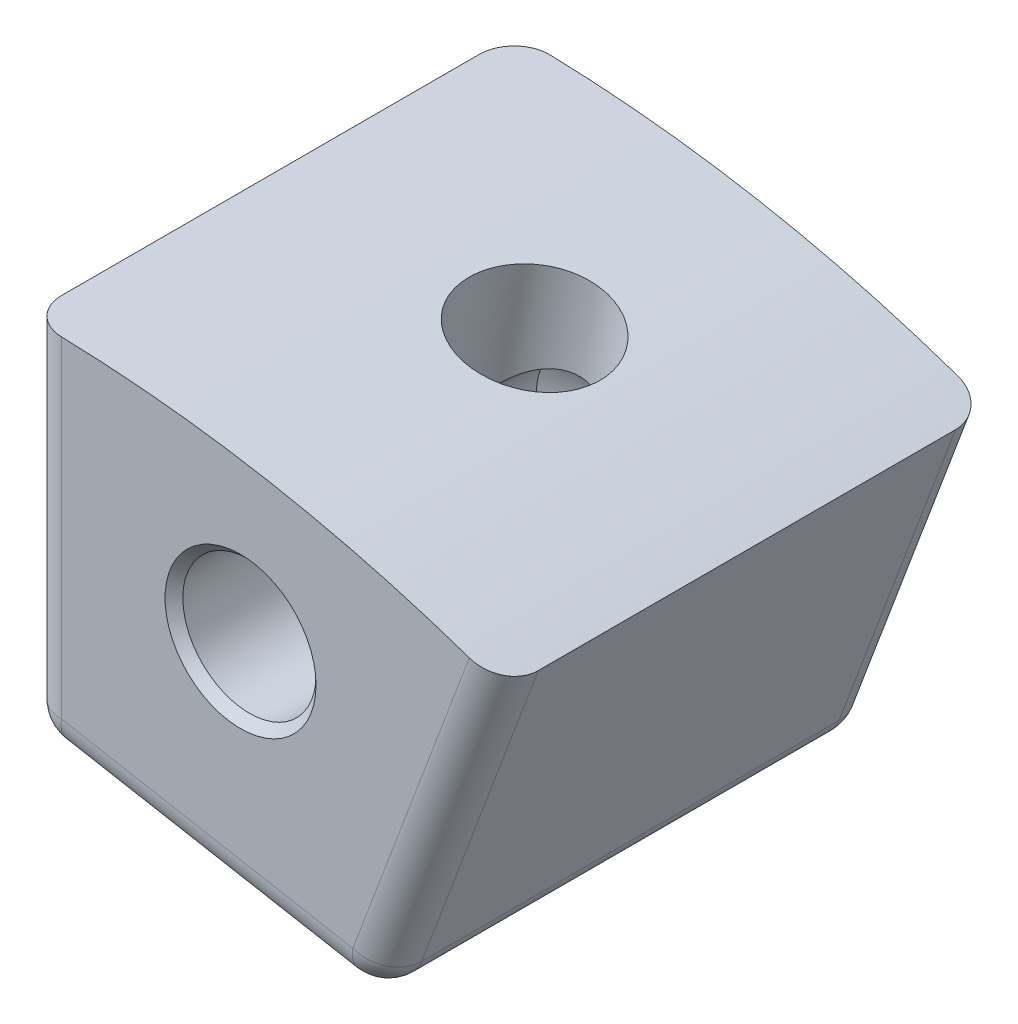
ISO-10303-21;
HEADER;
FILE_DESCRIPTION(('STEP AP214'),'2;1');
FILE_NAME('part.step','',(''),(''),'','','');
FILE_SCHEMA(('AUTOMOTIVE_DESIGN { 1 0 10303 214 1 1 1 1 }'));
ENDSEC;
DATA;
#1=APPLICATION_CONTEXT('core data for automotive mechanical design processes');
#2=APPLICATION_PROTOCOL_DEFINITION('international standard','automotive_design',2000,#1);
#3=PRODUCT_CONTEXT('',#1,'mechanical');
#4=PRODUCT('Part','Part','',(#3));
#5=PRODUCT_RELATED_PRODUCT_CATEGORY('part','',(#4));
#6=PRODUCT_DEFINITION_FORMATION('','',#4);
#7=PRODUCT_DEFINITION_CONTEXT('part definition',#1,'design');
#8=PRODUCT_DEFINITION('design','',#6,#7);
#9=PRODUCT_DEFINITION_SHAPE('','',#8);
#10=(LENGTH_UNIT() NAMED_UNIT(*) SI_UNIT(.MILLI.,.METRE.));
#11=(NAMED_UNIT(*) PLANE_ANGLE_UNIT() SI_UNIT($,.RADIAN.));
#12=(NAMED_UNIT(*) SI_UNIT($,.STERADIAN.) SOLID_ANGLE_UNIT());
#13=UNCERTAINTY_MEASURE_WITH_UNIT(LENGTH_MEASURE(1.E-05),#10,'distance_accuracy_value','');
#14=(GEOMETRIC_REPRESENTATION_CONTEXT(3) GLOBAL_UNCERTAINTY_ASSIGNED_CONTEXT((#13)) GLOBAL_UNIT_ASSIGNED_CONTEXT((#10,
#11,#12)) REPRESENTATION_CONTEXT('',''));
#15=CARTESIAN_POINT('',(0.,0.,0.));
#16=DIRECTION('',(0.,0.,1.));
#17=DIRECTION('',(1.,0.,0.));
#18=AXIS2_PLACEMENT_3D('',#15,#16,#17);
#19=CARTESIAN_POINT('',(0.,0.,34.925));
#20=DIRECTION('',(0.936047275217543,-0.351874265267883,0.));
#21=DIRECTION('',(0.351874265267883,0.936047275217543,0.));
#22=AXIS2_PLACEMENT_3D('',#19,#20,#21);
#23=PLANE('',#22);
#24=DIRECTION('',(0.,0.,-1.));
#25=VECTOR('',#24,1.);
#26=CARTESIAN_POINT('',(25.7365632458568,68.4637732214032,0.));
#27=LINE('',#26,#25);
#28=CARTESIAN_POINT('',(25.7365632458568,68.4637732214032,32.385));
#29=VERTEX_POINT('',#28);
#30=CARTESIAN_POINT('',(25.7365632458568,68.4637732214032,2.54));
#31=VERTEX_POINT('',#30);
#32=EDGE_CURVE('E264',#29,#31,#27,.T.);
#33=ORIENTED_EDGE('',*,*,#32,.T.);
#34=DIRECTION('',(-0.351874265267883,-0.936047275217543,0.));
#35=VECTOR('',#34,1.);
#36=CARTESIAN_POINT('',(34.0746241628786,90.6444780138789,2.54));
#37=LINE('',#36,#35);
#38=CARTESIAN_POINT('',(34.0746241628786,90.6444780138788,2.54));
#39=VERTEX_POINT('',#38);
#40=EDGE_CURVE('E11',#31,#39,#37,.F.);
#41=ORIENTED_EDGE('',*,*,#40,.T.);
#42=DIRECTION('',(0.,0.,-1.));
#43=VECTOR('',#42,1.);
#44=CARTESIAN_POINT('',(34.0746241628786,90.6444780138788,34.925));
#45=LINE('',#44,#43);
#46=CARTESIAN_POINT('',(34.0746241628786,90.6444780138788,32.385));
#47=VERTEX_POINT('',#46);
#48=EDGE_CURVE('E360',#47,#39,#45,.T.);
#49=ORIENTED_EDGE('',*,*,#48,.F.);
#50=DIRECTION('',(-0.351874265267883,-0.936047275217543,0.));
#51=VECTOR('',#50,1.);
#52=CARTESIAN_POINT('',(0.,0.,32.385));
#53=LINE('',#52,#51);
#54=EDGE_CURVE('E269',#47,#29,#53,.T.);
#55=ORIENTED_EDGE('',*,*,#54,.T.);
#56=EDGE_LOOP('',(#33,#41,#49,#55));
#57=FACE_BOUND('',#56,.T.);
#58=ADVANCED_FACE('F45',(#57),#23,.T.);
#59=CARTESIAN_POINT('',(0.,0.,34.925));
#60=DIRECTION('',(0.,0.,-1.));
#61=DIRECTION('',(-1.,0.,0.));
#62=AXIS2_PLACEMENT_3D('',#59,#60,#61);
#63=CYLINDRICAL_SURFACE('',#62,96.8375);
#64=CARTESIAN_POINT('',(12.6097274840979,96.0130000522158,15.875));
#65=CARTESIAN_POINT('',(12.6097264337709,96.0130000982698,16.0087169795758));
#66=CARTESIAN_POINT('',(12.6153202061026,96.0122660124806,16.1424171714099));
#67=CARTESIAN_POINT('',(12.6376545638643,96.009328841513,16.4089106540673));
#68=CARTESIAN_POINT('',(12.6543980193311,96.0071253781022,16.5417037024894));
#69=CARTESIAN_POINT('',(12.6989322266272,96.0012449371573,16.8055075697956));
#70=CARTESIAN_POINT('',(12.7267325686475,95.9975666804386,16.9365167391425));
#71=CARTESIAN_POINT('',(12.7931879767186,95.9887330400355,17.1957533270281));
#72=CARTESIAN_POINT('',(12.8318470106102,95.9835771163873,17.3239797102322));
#73=CARTESIAN_POINT('',(12.9196933840178,95.9717921555051,17.5765773818267));
#74=CARTESIAN_POINT('',(12.968871457817,95.9651644145293,17.7009519534236));
#75=CARTESIAN_POINT('',(13.0774367221704,95.950430197253,17.9451268057173));
#76=CARTESIAN_POINT('',(13.1368276704419,95.9423231766003,18.0649253828274));
#77=CARTESIAN_POINT('',(13.2653341298993,95.9246397880624,18.2989792318412));
#78=CARTESIAN_POINT('',(13.3344437210756,95.9150643143509,18.4132378218113));
#79=CARTESIAN_POINT('',(13.4819401690518,95.8944432186642,18.6355221768293));
#80=CARTESIAN_POINT('',(13.5603304435378,95.8833970549078,18.7435456238156));
#81=CARTESIAN_POINT('',(13.7258406224072,95.8598440086538,18.9526009278252));
#82=CARTESIAN_POINT('',(13.812964802504,95.8473364102048,19.053629319075));
#83=CARTESIAN_POINT('',(13.9953141341957,95.820880171416,19.247956450197));
#84=CARTESIAN_POINT('',(14.0905422659883,95.8069310005355,19.3412523213506));
#85=CARTESIAN_POINT('',(14.2883515720941,95.7776299891186,19.519381867384));
#86=CARTESIAN_POINT('',(14.3909303239229,95.7622786102426,19.604218308327));
#87=CARTESIAN_POINT('',(14.6027684994685,95.7302044107346,19.7648916592407));
#88=CARTESIAN_POINT('',(14.7120303754421,95.7134810859134,19.8407252353842));
#89=CARTESIAN_POINT('',(14.9364286075251,95.6787196562656,19.9828260075398));
#90=CARTESIAN_POINT('',(15.0515656746484,95.6606813921917,20.049092041957));
#91=CARTESIAN_POINT('',(15.2869143894984,95.6233541476357,20.1715973069212));
#92=CARTESIAN_POINT('',(15.4071278964905,95.6040647074945,20.2278328236631));
#93=CARTESIAN_POINT('',(15.6516920287323,95.5643305096099,20.3298264780207));
#94=CARTESIAN_POINT('',(15.7760410841597,95.5438861882376,20.375588540443));
#95=CARTESIAN_POINT('',(16.0280267055225,95.5019378882693,20.4563486284289));
#96=CARTESIAN_POINT('',(16.1556644670684,95.4804335216231,20.4913426776877));
#97=CARTESIAN_POINT('',(16.5418428009408,95.41455136751,20.5796640877488));
#98=CARTESIAN_POINT('',(16.8041170662697,95.3687286668414,20.6165256069463));
#99=CARTESIAN_POINT('',(17.330499936498,95.2744814065114,20.6450106597346));
#100=CARTESIAN_POINT('',(17.594608527308,95.2260568668155,20.6366345404133));
#101=CARTESIAN_POINT('',(18.1171033792273,95.1280322876324,20.5749705272961));
#102=CARTESIAN_POINT('',(18.37549439202,95.0784333010608,20.5217214840228));
#103=CARTESIAN_POINT('',(18.8794556537255,94.979648142739,20.3718677359072));
#104=CARTESIAN_POINT('',(19.1250258501679,94.9304619726789,20.2752628536431));
#105=CARTESIAN_POINT('',(19.5965771941678,94.8342425504268,20.0413995529447));
#106=CARTESIAN_POINT('',(19.8225497520565,94.7872102464968,19.9041234235045));
#107=CARTESIAN_POINT('',(20.2484835638455,94.697137165189,19.5928262142636));
#108=CARTESIAN_POINT('',(20.4484446403499,94.6540964150339,19.4188048838851));
#109=CARTESIAN_POINT('',(20.8170010031004,94.573725590792,19.0387376954902));
#110=CARTESIAN_POINT('',(20.9855628521417,94.5364016119563,18.8326581220657));
#111=CARTESIAN_POINT('',(21.2863785712438,94.4691236865632,18.3944426757807));
#112=CARTESIAN_POINT('',(21.4186324318896,94.4391697419168,18.1623067961634));
#113=CARTESIAN_POINT('',(21.6431630204133,94.3879665426444,17.6785478006151));
#114=CARTESIAN_POINT('',(21.7354385074731,94.3667175581974,17.4269240801211));
#115=CARTESIAN_POINT('',(21.8774374576774,94.3338989621334,16.9113413049208));
#116=CARTESIAN_POINT('',(21.9271612304554,94.3223292800838,16.6473823399885));
#117=CARTESIAN_POINT('',(21.9826419968879,94.3094146165876,16.1149179617259));
#118=CARTESIAN_POINT('',(21.988444989211,94.3080589379209,15.8464176002016));
#119=CARTESIAN_POINT('',(21.9560439615805,94.3156074350139,15.31223194224));
#120=CARTESIAN_POINT('',(21.9178400823427,94.324511577967,15.046546636804));
#121=CARTESIAN_POINT('',(21.7985188241056,94.3521578568163,14.5256653756822));
#122=CARTESIAN_POINT('',(21.7174225038293,94.3708951649294,14.2704643387821));
#123=CARTESIAN_POINT('',(21.5145803501038,94.417344813966,13.7776393414879));
#124=CARTESIAN_POINT('',(21.3928342891723,94.4450572051156,13.5400154794675));
#125=CARTESIAN_POINT('',(21.1119478327881,94.5082415796613,13.0888730482716));
#126=CARTESIAN_POINT('',(20.9527763988756,94.5437200020636,12.8753747062041));
#127=CARTESIAN_POINT('',(20.6015044553432,94.6208838955605,12.4787473031764));
#128=CARTESIAN_POINT('',(20.4094037416475,94.6625694051227,12.2956184304418));
#129=CARTESIAN_POINT('',(19.9974312173249,94.7504536780258,11.9647694848802));
#130=CARTESIAN_POINT('',(19.7775357586899,94.7966562768718,11.8170798779212));
#131=CARTESIAN_POINT('',(19.3162281633352,94.8917283106778,11.5615115245329));
#132=CARTESIAN_POINT('',(19.0748161179919,94.940597734312,11.4536326090464));
#133=CARTESIAN_POINT('',(18.5774141882452,95.0391779734488,11.2807958990739));
#134=CARTESIAN_POINT('',(18.3214309846347,95.0888883961268,11.2158186038951));
#135=CARTESIAN_POINT('',(17.8018322180675,95.1875302179342,11.1305855385252));
#136=CARTESIAN_POINT('',(17.5382166963313,95.2364616212687,11.110329526849));
#137=CARTESIAN_POINT('',(17.1431928633069,95.3080817073671,11.1138661018212));
#138=CARTESIAN_POINT('',(17.0115836453829,95.3316591036374,11.1206986062151));
#139=CARTESIAN_POINT('',(16.7493148315705,95.3780872625981,11.1455846488024));
#140=CARTESIAN_POINT('',(16.6186549027394,95.4009382905822,11.1636340395493));
#141=CARTESIAN_POINT('',(16.3591649466284,95.4457777487616,11.2108384852169));
#142=CARTESIAN_POINT('',(16.2303356146225,95.4677658565198,11.2399976486231));
#143=CARTESIAN_POINT('',(15.9755119252488,95.5107381936583,11.3091974096719));
#144=CARTESIAN_POINT('',(15.849516541711,95.5317227896129,11.3492339976218));
#145=CARTESIAN_POINT('',(15.6011692676313,95.5725942394032,11.4399252922864));
#146=CARTESIAN_POINT('',(15.4788187617995,95.5924806784316,11.490583977098));
#147=CARTESIAN_POINT('',(15.2387304604636,95.6310476719757,11.6021285297912));
#148=CARTESIAN_POINT('',(15.120990984016,95.6497286675731,11.6630106271292));
#149=CARTESIAN_POINT('',(14.890882207102,95.6858223745719,11.7946044018872));
#150=CARTESIAN_POINT('',(14.7785147239272,95.7032346578101,11.8653193744906));
#151=CARTESIAN_POINT('',(14.5600389973123,95.7367164771253,12.0160334434758));
#152=CARTESIAN_POINT('',(14.4539284685908,95.7527865043505,12.0960291181095));
#153=CARTESIAN_POINT('',(14.2485486659541,95.7835636523922,12.264870073404));
#154=CARTESIAN_POINT('',(14.1492885831118,95.7982689509614,12.353726866717));
#155=CARTESIAN_POINT('',(13.9585145271971,95.8262519990268,12.5395372591897));
#156=CARTESIAN_POINT('',(13.8669977171235,95.8395302718465,12.6364878668244));
#157=CARTESIAN_POINT('',(13.6922765154636,95.8646481614532,12.8378895237048));
#158=CARTESIAN_POINT('',(13.6090772742859,95.8764868878128,12.942345152257));
#159=CARTESIAN_POINT('',(13.4516876159981,95.8986956269046,13.1579233781543));
#160=CARTESIAN_POINT('',(13.3774938880412,95.9090661796406,13.2690435027334));
#161=CARTESIAN_POINT('',(13.2385271082338,95.9283468850192,13.4973484070362));
#162=CARTESIAN_POINT('',(13.1737665650152,95.9372551005179,13.6145409649143));
#163=CARTESIAN_POINT('',(13.0542775868105,95.9535871118471,13.8539781593823));
#164=CARTESIAN_POINT('',(12.999545488779,95.9610114497771,13.976220931229));
#165=CARTESIAN_POINT('',(12.9005278290686,95.9743730621273,14.2248234333528));
#166=CARTESIAN_POINT('',(12.8562331722346,95.9803116315224,14.3511794692308));
#167=CARTESIAN_POINT('',(12.7783646836452,95.9907096653658,14.6071672777435));
#168=CARTESIAN_POINT('',(12.7447880790948,95.9951695123759,14.7367981937761));
#169=CARTESIAN_POINT('',(12.68117742669,96.0035960249228,15.0329631927168));
#170=CARTESIAN_POINT('',(12.6544078096981,96.0071231243848,15.2002211850107));
#171=CARTESIAN_POINT('',(12.6186835101163,96.0118251079287,15.5366617410461));
#172=CARTESIAN_POINT('',(12.6097288127909,96.0129999939562,15.7058443031954));
#173=CARTESIAN_POINT('',(12.6097274840979,96.0130000522158,15.875));
#174=B_SPLINE_CURVE_WITH_KNOTS('',3,(#64,#65,#66,#67,#68,#69,#70,#71,#72,#73,#74,#75,#76,#77,
#78,#79,#80,#81,#82,#83,#84,#85,#86,#87,#88,#89,#90,#91,#92,#93,#94,#95,#96,#97,#98,#99,#100,
#101,#102,#103,#104,#105,#106,#107,#108,#109,#110,#111,#112,#113,#114,#115,#116,#117,#118,#119,
#120,#121,#122,#123,#124,#125,#126,#127,#128,#129,#130,#131,#132,#133,#134,#135,#136,#137,#138,
#139,#140,#141,#142,#143,#144,#145,#146,#147,#148,#149,#150,#151,#152,#153,#154,#155,#156,#157,
#158,#159,#160,#161,#162,#163,#164,#165,#166,#167,#168,#169,#170,#171,#172,#173),.UNSPECIFIED.,
.T.,.F.,(4,2,2,2,2,2,2,2,2,2,2,2,2,2,2,2,2,2,2,2,2,2,2,2,2,2,2,2,2,2,2,2,2,2,2,2,2,2,2,2,2,2,2,
2,2,2,2,2,2,2,2,2,2,2,4),(0.,0.401003144827281,0.802109551683822,1.20356461955158,
1.60516657313519,2.00641622102467,2.40781382153573,2.80896796556318,3.21027030004428,
3.61177006186316,4.01341811708359,4.41493440783329,4.81659892229109,5.21831216189583,
5.62017382871798,6.02188465501646,6.42374364356218,7.22594149089511,8.02813318333484,
8.82963105905199,9.63113221470724,10.432982912354,11.2348390782648,12.0375443235995,
12.8402497770848,13.6429801425423,14.4457046667705,15.2475883731617,16.0494695154642,
16.8509573264816,17.6524496228235,18.4546089902471,19.2567733291528,20.0596248091394,
20.8624728797516,21.6649557685476,22.467434324103,22.8686808192557,23.2697790416161,
23.6710257376091,24.0721247241782,24.4733741960699,24.8744760050339,25.2757125562456,
25.6768016408957,26.0784187961066,26.4798881627476,26.8816046073284,27.2831729119649,
27.6852689509008,28.0872178239492,28.4888151338664,28.8903084648971,29.3975890115132,
29.9048691385344),.UNSPECIFIED.);
#175=CARTESIAN_POINT('',(12.6097274840979,96.0130000522158,15.875));
#176=VERTEX_POINT('',#175);
#177=EDGE_CURVE('E146',#176,#176,#174,.T.);
#178=ORIENTED_EDGE('',*,*,#177,.F.);
#179=EDGE_LOOP('',(#178));
#180=FACE_BOUND('',#179,.T.);
#181=CARTESIAN_POINT('',(0.,0.,0.));
#182=DIRECTION('',(0.,0.,1.));
#183=DIRECTION('',(1.,0.,0.));
#184=AXIS2_PLACEMENT_3D('',#181,#182,#183);
#185=CIRCLE('',#184,96.8375);
#186=CARTESIAN_POINT('',(31.6853406161457,91.5070521669714,0.));
#187=VERTEX_POINT('',#186);
#188=CARTESIAN_POINT('',(2.54,96.8041827931521,0.));
#189=VERTEX_POINT('',#188);
#190=EDGE_CURVE('E553',#187,#189,#185,.T.);
#191=ORIENTED_EDGE('',*,*,#190,.T.);
#192=CARTESIAN_POINT('',(2.54,96.8041827931521,0.));
#193=CARTESIAN_POINT('',(2.46858536009923,96.8060573768439,-6.85103592360746E-06));
#194=CARTESIAN_POINT('',(2.39717176573972,96.8078513320911,0.00301181871580427));
#195=CARTESIAN_POINT('',(2.25485103234386,96.8112704221657,0.0150482848171636));
#196=CARTESIAN_POINT('',(2.18394387030531,96.8128955647066,0.0240658069243203));
#197=CARTESIAN_POINT('',(2.04318658030035,96.8159684851263,0.0480390728825002));
#198=CARTESIAN_POINT('',(1.97333569901908,96.8174163951927,0.0629903553366133));
#199=CARTESIAN_POINT('',(1.83515521960841,96.8201342553012,0.098710685084041));
#200=CARTESIAN_POINT('',(1.76682560182568,96.8214042076435,0.119479657171034));
#201=CARTESIAN_POINT('',(1.56477705670751,96.824950011736,0.190346976867392));
#202=CARTESIAN_POINT('',(1.43394273641042,96.8269630095802,0.249015264005096));
#203=CARTESIAN_POINT('',(1.18406999229853,96.8303416149829,0.387448006552209));
#204=CARTESIAN_POINT('',(1.06502945416826,96.8317073387475,0.46720867121053));
#205=CARTESIAN_POINT('',(0.842025387775158,96.8339033587302,0.645573282192857));
#206=CARTESIAN_POINT('',(0.738058997782629,96.83473375668,0.74417364366221));
#207=CARTESIAN_POINT('',(0.548134750519402,96.8359953963259,0.957448916495261));
#208=CARTESIAN_POINT('',(0.462180444492031,96.8364265593665,1.07212699029897));
#209=CARTESIAN_POINT('',(0.3107213333046,96.8370312190637,1.31430568930315));
#210=CARTESIAN_POINT('',(0.245222143243004,96.8372046450184,1.4418098226859));
#211=CARTESIAN_POINT('',(0.136591039497411,96.8374189999318,1.70597883821877));
#212=CARTESIAN_POINT('',(0.0934460617311503,96.8374600063516,1.84263831701036));
#213=CARTESIAN_POINT('',(0.0414494888781317,96.8374933180253,2.07344233088557));
#214=CARTESIAN_POINT('',(0.0259153889156371,96.8374974852978,2.16613657821611));
#215=CARTESIAN_POINT('',(0.00519195410018789,96.8375000183016,2.35254094389164));
#216=CARTESIAN_POINT('',(-1.20151978514455E-05,96.8374983922493,2.44624943574588));
#217=CARTESIAN_POINT('',(0.,96.8375,2.54));
#218=B_SPLINE_CURVE_WITH_KNOTS('',3,(#192,#193,#194,#195,#196,#197,#198,#199,#200,#201,#202,
#203,#204,#205,#206,#207,#208,#209,#210,#211,#212,#213,#214,#215,#216,#217),.UNSPECIFIED.,.F.,
.F.,(4,2,2,2,2,2,2,2,2,2,2,2,4),(0.,0.21424818780003,0.428486581740772,0.642564201200222,
0.856639053367422,1.28462132140182,1.71252672408735,2.14035078502982,2.56825911611391,
2.99628480853102,3.42406007440669,3.70548451365892,3.98650998040254),.UNSPECIFIED.);
#219=CARTESIAN_POINT('',(0.,96.8375,2.54));
#220=VERTEX_POINT('',#219);
#221=EDGE_CURVE('E224',#189,#220,#218,.T.);
#222=ORIENTED_EDGE('',*,*,#221,.T.);
#223=DIRECTION('',(0.,0.,-1.));
#224=VECTOR('',#223,1.);
#225=CARTESIAN_POINT('',(0.,96.8375,34.925));
#226=LINE('',#225,#224);
#227=CARTESIAN_POINT('',(0.,96.8375,32.385));
#228=VERTEX_POINT('',#227);
#229=EDGE_CURVE('E366',#228,#220,#226,.T.);
#230=ORIENTED_EDGE('',*,*,#229,.F.);
#231=CARTESIAN_POINT('',(0.,96.8375,32.385));
#232=CARTESIAN_POINT('',(-6.8451547772575E-06,96.8374994110753,32.4564411224437));
#233=CARTESIAN_POINT('',(0.003014050604484,96.8374999846236,32.5278790002181));
#234=CARTESIAN_POINT('',(0.0150583514419801,96.8374991722023,32.6702436386607));
#235=CARTESIAN_POINT('',(0.0240814687664181,96.8374977863266,32.7411704236665));
#236=CARTESIAN_POINT('',(0.0480682011881088,96.8374887747575,32.881962083635));
#237=CARTESIAN_POINT('',(0.0630273309845668,96.8374811537709,32.9518277191208));
#238=CARTESIAN_POINT('',(0.0987647466682605,96.837451267349,33.0900334495545));
#239=CARTESIAN_POINT('',(0.119542961517244,96.8374290020925,33.1583735631146));
#240=CARTESIAN_POINT('',(0.190438394808741,96.8373244685393,33.3604462679298));
#241=CARTESIAN_POINT('',(0.249126209047279,96.83720447491,33.4912884808957));
#242=CARTESIAN_POINT('',(0.387596264613066,96.8367488845796,33.7411665570751));
#243=CARTESIAN_POINT('',(0.467374791762224,96.8364133258258,33.8602044940088));
#244=CARTESIAN_POINT('',(0.64578501454419,96.8353876681424,34.083213045278));
#245=CARTESIAN_POINT('',(0.744415983492169,96.8346975828765,34.1871842401033));
#246=CARTESIAN_POINT('',(0.957750823827636,96.8328222885565,34.3771065926896));
#247=CARTESIAN_POINT('',(1.07245778911582,96.8316369841079,34.463054273774));
#248=CARTESIAN_POINT('',(1.31466356225916,96.8286513474236,34.6144745520011));
#249=CARTESIAN_POINT('',(1.44216331424035,96.826850969771,34.6799456364713));
#250=CARTESIAN_POINT('',(1.70630821522898,96.8225558254433,34.7885219643697));
#251=CARTESIAN_POINT('',(1.84294799873564,96.8200614634894,34.8316402018032));
#252=CARTESIAN_POINT('',(2.07368494580055,96.8153378370168,34.8835942729197));
#253=CARTESIAN_POINT('',(2.16633686229383,96.8133100243636,34.8991126157977));
#254=CARTESIAN_POINT('',(2.35264754852437,96.8089624668653,34.9198141508202));
#255=CARTESIAN_POINT('',(2.4463046974888,96.8066431416413,34.9250120217581));
#256=CARTESIAN_POINT('',(2.54,96.8041827931521,34.925));
#257=B_SPLINE_CURVE_WITH_KNOTS('',3,(#231,#232,#233,#234,#235,#236,#237,#238,#239,#240,#241,
#242,#243,#244,#245,#246,#247,#248,#249,#250,#251,#252,#253,#254,#255,#256),.UNSPECIFIED.,.F.,
.F.,(4,2,2,2,2,2,2,2,2,2,2,2,4),(0.,0.214253668543441,0.428497066245808,0.642578887159721,
0.856658094718563,1.28464443105287,1.71255544704151,2.14044997212875,2.56842696089371,
2.99643555823947,3.42419506874274,3.70555263539336,3.98650974007406),.UNSPECIFIED.);
#258=CARTESIAN_POINT('',(2.54,96.8041827931521,34.925));
#259=VERTEX_POINT('',#258);
#260=EDGE_CURVE('E198',#228,#259,#257,.T.);
#261=ORIENTED_EDGE('',*,*,#260,.T.);
#262=CARTESIAN_POINT('',(0.,0.,34.925));
#263=DIRECTION('',(0.,0.,1.));
#264=DIRECTION('',(1.,0.,0.));
#265=AXIS2_PLACEMENT_3D('',#262,#263,#264);
#266=CIRCLE('',#265,96.8375);
#267=CARTESIAN_POINT('',(31.6853406161457,91.5070521669714,34.925));
#268=VERTEX_POINT('',#267);
#269=EDGE_CURVE('E362',#268,#259,#266,.T.);
#270=ORIENTED_EDGE('',*,*,#269,.F.);
#271=CARTESIAN_POINT('',(31.6853406161457,91.5070521669714,34.925));
#272=CARTESIAN_POINT('',(31.7528477129947,91.4836778919838,34.9250068510359));
#273=CARTESIAN_POINT('',(31.8203254600929,91.4602285128595,34.9219881812842));
#274=CARTESIAN_POINT('',(31.954747484603,91.4133499393115,34.9099517151828));
#275=CARTESIAN_POINT('',(32.0216917862601,91.3899207440142,34.9009341930757));
#276=CARTESIAN_POINT('',(32.1545285456512,91.3432682747984,34.8769609271175));
#277=CARTESIAN_POINT('',(32.2204217550368,91.3200448595417,34.8620096446634));
#278=CARTESIAN_POINT('',(32.3507215613062,91.2739667504236,34.826289314916));
#279=CARTESIAN_POINT('',(32.4151281773958,91.2511120518,34.805520342829));
#280=CARTESIAN_POINT('',(32.6055028447251,91.1833354086973,34.7346530231326));
#281=CARTESIAN_POINT('',(32.7286782758816,91.139182439518,34.6759847359949));
#282=CARTESIAN_POINT('',(32.9637598214523,91.0544211856545,34.5375519934478));
#283=CARTESIAN_POINT('',(33.0756679558558,91.0138122657713,34.4577913287895));
#284=CARTESIAN_POINT('',(33.2851830274834,90.9373984522786,34.2794267178071));
#285=CARTESIAN_POINT('',(33.3827926792186,90.9015926469256,34.1808263563378));
#286=CARTESIAN_POINT('',(33.5610146918905,90.8359441463162,33.9675510835047));
#287=CARTESIAN_POINT('',(33.6416237010188,90.8061026270256,33.852873009701));
#288=CARTESIAN_POINT('',(33.7836093535394,90.7533740536204,33.6106943106969));
#289=CARTESIAN_POINT('',(33.8449807160559,90.7304889091342,33.4831901773141));
#290=CARTESIAN_POINT('',(33.9467399906985,90.6924650656511,33.2190211617812));
#291=CARTESIAN_POINT('',(33.9871401586798,90.6773218422471,33.0823616829896));
#292=CARTESIAN_POINT('',(34.0358231305402,90.6590567676794,32.8515576691144));
#293=CARTESIAN_POINT('',(34.050365248839,90.6535946184325,32.7588634217839));
#294=CARTESIAN_POINT('',(34.0697642548299,90.6463049460443,32.5724590561084));
#295=CARTESIAN_POINT('',(34.0746348439457,90.6444722811092,32.4787505642541));
#296=CARTESIAN_POINT('',(34.0746241628786,90.6444780138789,32.385));
#297=B_SPLINE_CURVE_WITH_KNOTS('',3,(#271,#272,#273,#274,#275,#276,#277,#278,#279,#280,#281,
#282,#283,#284,#285,#286,#287,#288,#289,#290,#291,#292,#293,#294,#295,#296),.UNSPECIFIED.,.F.,
.F.,(4,2,2,2,2,2,2,2,2,2,2,2,4),(0.,0.214248187800032,0.428486581740765,0.642564201200218,
0.856639053367421,1.28462132140182,1.71252672408736,2.14035078502982,2.56825911611391,
2.99628480853102,3.42406007440669,3.70548451365892,3.98650998040254),.UNSPECIFIED.);
#298=EDGE_CURVE('E208',#268,#47,#297,.T.);
#299=ORIENTED_EDGE('',*,*,#298,.T.);
#300=ORIENTED_EDGE('',*,*,#48,.T.);
#301=CARTESIAN_POINT('',(34.0746241628786,90.6444780138788,2.54));
#302=CARTESIAN_POINT('',(34.0746303630396,90.6444750539836,2.46855887755633));
#303=CARTESIAN_POINT('',(34.0718028636124,90.6455385663277,2.39712099978192));
#304=CARTESIAN_POINT('',(34.0605285427614,90.6497758853709,2.2547563613393));
#305=CARTESIAN_POINT('',(34.0520819907219,90.6529495909047,2.18382957633345));
#306=CARTESIAN_POINT('',(34.0296261042579,90.6613814694971,2.04303791636502));
#307=CARTESIAN_POINT('',(34.0156209699433,90.6666380686994,1.97317228087917));
#308=CARTESIAN_POINT('',(33.9821585431065,90.6791851704819,1.83496655044548));
#309=CARTESIAN_POINT('',(33.9627013171424,90.6864756482329,1.76662643688536));
#310=CARTESIAN_POINT('',(33.8963030573174,90.7113240783855,1.56455373207016));
#311=CARTESIAN_POINT('',(33.8413262660407,90.7318624901911,1.43371151910426));
#312=CARTESIAN_POINT('',(33.7115514373164,90.7801600851676,1.18383344292493));
#313=CARTESIAN_POINT('',(33.6367568898676,90.8079179969351,1.06479550599115));
#314=CARTESIAN_POINT('',(33.4693955844178,90.8697358989129,0.841786954722047));
#315=CARTESIAN_POINT('',(33.3768295114361,90.9037956462114,0.737815759896697));
#316=CARTESIAN_POINT('',(33.1764781476201,90.977107322272,0.547893407310353));
#317=CARTESIAN_POINT('',(33.0686899271817,91.0163602504044,0.461945726225948));
#318=CARTESIAN_POINT('',(32.8409233044742,91.0987915317897,0.310525447998906));
#319=CARTESIAN_POINT('',(32.7209440024776,91.1419701747439,0.24505436352869));
#320=CARTESIAN_POINT('',(32.47218053689,91.2308955095589,0.136478035630322));
#321=CARTESIAN_POINT('',(32.3434015380725,91.2766406922763,0.0933597981967902));
#322=CARTESIAN_POINT('',(32.1257587248859,91.3534095483061,0.0414057270802777));
#323=CARTESIAN_POINT('',(32.0383186158213,91.3841132448392,0.0258873842023167));
#324=CARTESIAN_POINT('',(31.8623932120308,91.445601661318,0.00518584917983039));
#325=CARTESIAN_POINT('',(31.7739095820789,91.4763862037406,-1.20217580812616E-05));
#326=CARTESIAN_POINT('',(31.6853406161457,91.5070521669714,0.));
#327=B_SPLINE_CURVE_WITH_KNOTS('',3,(#301,#302,#303,#304,#305,#306,#307,#308,#309,#310,#311,
#312,#313,#314,#315,#316,#317,#318,#319,#320,#321,#322,#323,#324,#325,#326),.UNSPECIFIED.,.F.,
.F.,(4,2,2,2,2,2,2,2,2,2,2,2,4),(0.,0.21425366854344,0.428497066245811,0.642578887159727,
0.856658094718564,1.28464443105287,1.71255544704151,2.14044997212875,2.56842696089372,
2.99643555823948,3.42419506874275,3.70555263539336,3.98650974007406),.UNSPECIFIED.);
#328=EDGE_CURVE('E217',#39,#187,#327,.T.);
#329=ORIENTED_EDGE('',*,*,#328,.T.);
#330=EDGE_LOOP('',(#191,#222,#230,#261,#270,#299,#300,#329));
#331=FACE_BOUND('',#330,.T.);
#332=ADVANCED_FACE('F188',(#180,#331),#63,.T.);
#333=CARTESIAN_POINT('',(0.,0.,34.925));
#334=DIRECTION('',(1.,0.,0.));
#335=DIRECTION('',(0.,0.,-1.));
#336=AXIS2_PLACEMENT_3D('',#333,#334,#335);
#337=PLANE('',#336);
#338=ORIENTED_EDGE('',*,*,#229,.T.);
#339=DIRECTION('',(0.,-1.,0.));
#340=VECTOR('',#339,1.);
#341=CARTESIAN_POINT('',(0.,0.,2.54));
#342=LINE('',#341,#340);
#343=CARTESIAN_POINT('',(0.,73.1413626576626,2.54));
#344=VERTEX_POINT('',#343);
#345=EDGE_CURVE('E317',#220,#344,#342,.T.);
#346=ORIENTED_EDGE('',*,*,#345,.T.);
#347=DIRECTION('',(0.,0.,-1.));
#348=VECTOR('',#347,1.);
#349=CARTESIAN_POINT('',(0.,73.1413626576626,34.925));
#350=LINE('',#349,#348);
#351=CARTESIAN_POINT('',(0.,73.1413626576626,32.385));
#352=VERTEX_POINT('',#351);
#353=EDGE_CURVE('E305',#344,#352,#350,.F.);
#354=ORIENTED_EDGE('',*,*,#353,.T.);
#355=DIRECTION('',(0.,-1.,0.));
#356=VECTOR('',#355,1.);
#357=CARTESIAN_POINT('',(0.,96.8375,32.385));
#358=LINE('',#357,#356);
#359=EDGE_CURVE('E374',#352,#228,#358,.F.);
#360=ORIENTED_EDGE('',*,*,#359,.T.);
#361=EDGE_LOOP('',(#338,#346,#354,#360));
#362=FACE_BOUND('',#361,.T.);
#363=ADVANCED_FACE('F185',(#362),#337,.F.);
#364=CARTESIAN_POINT('',(12.4953004169536,68.7503881730324,34.925));
#365=DIRECTION('',(0.178819356869519,0.983881922594765,0.));
#366=DIRECTION('',(-0.983881922594765,0.178819356869519,0.));
#367=AXIS2_PLACEMENT_3D('',#364,#365,#366);
#368=PLANE('',#367);
#369=DIRECTION('',(0.,0.,-1.));
#370=VECTOR('',#369,1.);
#371=CARTESIAN_POINT('',(2.08579883355142,70.6423025742719,34.925));
#372=LINE('',#371,#370);
#373=CARTESIAN_POINT('',(2.08579883355142,70.6423025742719,32.385));
#374=VERTEX_POINT('',#373);
#375=CARTESIAN_POINT('',(2.08579883355142,70.6423025742719,2.54));
#376=VERTEX_POINT('',#375);
#377=EDGE_CURVE('E304',#374,#376,#372,.T.);
#378=ORIENTED_EDGE('',*,*,#377,.T.);
#379=DIRECTION('',(0.983881922594765,-0.178819356869519,0.));
#380=VECTOR('',#379,1.);
#381=CARTESIAN_POINT('',(12.4953004169536,68.7503881730324,2.54));
#382=LINE('',#381,#380);
#383=CARTESIAN_POINT('',(22.9048020003557,66.8584737717929,2.54));
#384=VERTEX_POINT('',#383);
#385=EDGE_CURVE('E71',#376,#384,#382,.T.);
#386=ORIENTED_EDGE('',*,*,#385,.T.);
#387=DIRECTION('',(0.,0.,-1.));
#388=VECTOR('',#387,1.);
#389=CARTESIAN_POINT('',(22.9048020003557,66.8584737717929,32.385));
#390=LINE('',#389,#388);
#391=CARTESIAN_POINT('',(22.9048020003557,66.8584737717929,32.385));
#392=VERTEX_POINT('',#391);
#393=EDGE_CURVE('E273',#384,#392,#390,.F.);
#394=ORIENTED_EDGE('',*,*,#393,.T.);
#395=DIRECTION('',(0.983881922594765,-0.178819356869519,0.));
#396=VECTOR('',#395,1.);
#397=CARTESIAN_POINT('',(2.53999999999999,70.5597520581901,32.385));
#398=LINE('',#397,#396);
#399=EDGE_CURVE('E309',#392,#374,#398,.F.);
#400=ORIENTED_EDGE('',*,*,#399,.T.);
#401=EDGE_LOOP('',(#378,#386,#394,#400));
#402=FACE_BOUND('',#401,.T.);
#403=ADVANCED_FACE('F178',(#402),#368,.F.);
#404=CARTESIAN_POINT('',(0.,0.,34.925));
#405=DIRECTION('',(0.,0.,1.));
#406=DIRECTION('',(1.,0.,0.));
#407=AXIS2_PLACEMENT_3D('',#404,#405,#406);
#408=PLANE('',#407);
#409=CARTESIAN_POINT('',(15.3292893676395,84.3432778144362,34.925));
#410=DIRECTION('',(0.,0.,1.));
#411=DIRECTION('',(1.,0.,0.));
#412=AXIS2_PLACEMENT_3D('',#409,#410,#411);
#413=CIRCLE('',#412,5.3975);
#414=CARTESIAN_POINT('',(20.7267893676395,84.3432778144362,34.925));
#415=VERTEX_POINT('',#414);
#416=EDGE_CURVE('E150',#415,#415,#413,.T.);
#417=ORIENTED_EDGE('',*,*,#416,.F.);
#418=EDGE_LOOP('',(#417));
#419=FACE_BOUND('',#418,.T.);
#420=DIRECTION('',(0.983881922594765,-0.178819356869519,0.));
#421=VECTOR('',#420,1.);
#422=CARTESIAN_POINT('',(25.4448020003557,68.9784424241802,34.925));
#423=LINE('',#422,#421);
#424=CARTESIAN_POINT('',(2.54,73.1413626576626,34.925));
#425=VERTEX_POINT('',#424);
#426=CARTESIAN_POINT('',(23.3590031668042,69.3575338551837,34.925));
#427=VERTEX_POINT('',#426);
#428=EDGE_CURVE('E342',#425,#427,#423,.T.);
#429=ORIENTED_EDGE('',*,*,#428,.T.);
#430=DIRECTION('',(-0.351874265267883,-0.936047275217543,0.));
#431=VECTOR('',#430,1.);
#432=CARTESIAN_POINT('',(-2.37756007905256,0.893760633780422,34.925));
#433=LINE('',#432,#431);
#434=EDGE_CURVE('E351',#427,#268,#433,.F.);
#435=ORIENTED_EDGE('',*,*,#434,.T.);
#436=ORIENTED_EDGE('',*,*,#269,.T.);
#437=DIRECTION('',(0.,-1.,0.));
#438=VECTOR('',#437,1.);
#439=CARTESIAN_POINT('',(2.54,71.0213940052753,34.925));
#440=LINE('',#439,#438);
#441=EDGE_CURVE('E365',#259,#425,#440,.T.);
#442=ORIENTED_EDGE('',*,*,#441,.T.);
#443=EDGE_LOOP('',(#429,#435,#436,#442));
#444=FACE_BOUND('',#443,.T.);
#445=ADVANCED_FACE('F175',(#419,#444),#408,.T.);
#446=CARTESIAN_POINT('',(0.,0.,0.));
#447=DIRECTION('',(0.,0.,1.));
#448=DIRECTION('',(1.,0.,0.));
#449=AXIS2_PLACEMENT_3D('',#446,#447,#448);
#450=PLANE('',#449);
#451=DIRECTION('',(0.983881922594765,-0.178819356869519,0.));
#452=VECTOR('',#451,1.);
#453=CARTESIAN_POINT('',(12.9495015834021,71.2494482564231,0.));
#454=LINE('',#453,#452);
#455=CARTESIAN_POINT('',(23.3590031668042,69.3575338551837,0.));
#456=VERTEX_POINT('',#455);
#457=CARTESIAN_POINT('',(2.54,73.1413626576626,0.));
#458=VERTEX_POINT('',#457);
#459=EDGE_CURVE('E321',#456,#458,#454,.F.);
#460=ORIENTED_EDGE('',*,*,#459,.T.);
#461=DIRECTION('',(0.,-1.,0.));
#462=VECTOR('',#461,1.);
#463=CARTESIAN_POINT('',(2.54,0.,0.));
#464=LINE('',#463,#462);
#465=EDGE_CURVE('E225',#458,#189,#464,.F.);
#466=ORIENTED_EDGE('',*,*,#465,.T.);
#467=ORIENTED_EDGE('',*,*,#190,.F.);
#468=DIRECTION('',(-0.351874265267883,-0.936047275217543,0.));
#469=VECTOR('',#468,1.);
#470=CARTESIAN_POINT('',(23.3590031668043,69.3575338551837,0.));
#471=LINE('',#470,#469);
#472=EDGE_CURVE('E323',#187,#456,#471,.T.);
#473=ORIENTED_EDGE('',*,*,#472,.T.);
#474=EDGE_LOOP('',(#460,#466,#467,#473));
#475=FACE_BOUND('',#474,.T.);
#476=ADVANCED_FACE('F173',(#475),#450,.F.);
#477=CARTESIAN_POINT('',(15.3292893676395,84.3432778144362,9.017));
#478=DIRECTION('',(0.,0.,1.));
#479=DIRECTION('',(1.,0.,0.));
#480=AXIS2_PLACEMENT_3D('',#477,#478,#479);
#481=CONICAL_SURFACE('',#480,4.76249999999999,1.02974425867665);
#482=CARTESIAN_POINT('',(15.3292893676395,84.3432778144362,6.15540130188124));
#483=VERTEX_POINT('',#482);
#484=VERTEX_LOOP('',#483);
#485=FACE_BOUND('',#484,.T.);
#486=CARTESIAN_POINT('',(15.3292893676395,84.3432778144362,9.017));
#487=DIRECTION('',(0.,0.,1.));
#488=DIRECTION('',(1.,0.,0.));
#489=AXIS2_PLACEMENT_3D('',#486,#487,#488);
#490=CIRCLE('',#489,4.76249999999999);
#491=CARTESIAN_POINT('',(20.0917893676395,84.3432778144362,9.017));
#492=VERTEX_POINT('',#491);
#493=EDGE_CURVE('E556',#492,#492,#490,.T.);
#494=ORIENTED_EDGE('',*,*,#493,.T.);
#495=EDGE_LOOP('',(#494));
#496=FACE_BOUND('',#495,.T.);
#497=ADVANCED_FACE('F170',(#485,#496),#481,.F.);
#498=CARTESIAN_POINT('',(15.3292893676395,84.3432778144362,34.925));
#499=DIRECTION('',(0.,0.,1.));
#500=DIRECTION('',(1.,0.,0.));
#501=AXIS2_PLACEMENT_3D('',#498,#499,#500);
#502=CYLINDRICAL_SURFACE('',#501,4.76249999999999);
#503=CARTESIAN_POINT('',(15.3292893676395,84.3432778144362,15.875));
#504=DIRECTION('',(0.126444379849854,0.695709579353616,-0.707106781186548));
#505=DIRECTION('',(0.126444379849854,0.695709579353616,0.707106781186548));
#506=AXIS2_PLACEMENT_3D('',#503,#504,#505);
#507=ELLIPSE('',#506,6.73519209080186,4.7625);
#508=CARTESIAN_POINT('',(20.0150270239971,83.4916506273452,15.875));
#509=VERTEX_POINT('',#508);
#510=CARTESIAN_POINT('',(10.6435517112819,85.1949050015273,15.875));
#511=VERTEX_POINT('',#510);
#512=EDGE_CURVE('E134',#509,#511,#507,.F.);
#513=ORIENTED_EDGE('',*,*,#512,.F.);
#514=CARTESIAN_POINT('',(15.3292893676395,84.3432778144362,15.875));
#515=DIRECTION('',(0.126444379849854,0.695709579353616,0.707106781186548));
#516=DIRECTION('',(0.126444379849854,0.695709579353616,-0.707106781186548));
#517=AXIS2_PLACEMENT_3D('',#514,#515,#516);
#518=ELLIPSE('',#517,6.73519209080186,4.7625);
#519=EDGE_CURVE('E138',#511,#509,#518,.F.);
#520=ORIENTED_EDGE('',*,*,#519,.F.);
#521=EDGE_LOOP('',(#513,#520));
#522=FACE_BOUND('',#521,.T.);
#523=ORIENTED_EDGE('',*,*,#493,.F.);
#524=EDGE_LOOP('',(#523));
#525=FACE_BOUND('',#524,.T.);
#526=CARTESIAN_POINT('',(15.3292893676395,84.3432778144362,34.29));
#527=DIRECTION('',(0.,0.,1.));
#528=DIRECTION('',(1.,0.,0.));
#529=AXIS2_PLACEMENT_3D('',#526,#527,#528);
#530=CIRCLE('',#529,4.7625);
#531=CARTESIAN_POINT('',(20.0917893676395,84.3432778144362,34.29));
#532=VERTEX_POINT('',#531);
#533=EDGE_CURVE('E561',#532,#532,#530,.T.);
#534=ORIENTED_EDGE('',*,*,#533,.T.);
#535=EDGE_LOOP('',(#534));
#536=FACE_BOUND('',#535,.T.);
#537=ADVANCED_FACE('F143',(#522,#525,#536),#502,.F.);
#538=CARTESIAN_POINT('',(15.3292893676395,84.3432778144362,34.925));
#539=DIRECTION('',(0.,0.,1.));
#540=DIRECTION('',(1.,0.,0.));
#541=AXIS2_PLACEMENT_3D('',#538,#539,#540);
#542=CONICAL_SURFACE('',#541,5.3975,0.785398163397448);
#543=ORIENTED_EDGE('',*,*,#533,.F.);
#544=EDGE_LOOP('',(#543));
#545=FACE_BOUND('',#544,.T.);
#546=ORIENTED_EDGE('',*,*,#416,.T.);
#547=EDGE_LOOP('',(#546));
#548=FACE_BOUND('',#547,.T.);
#549=ADVANCED_FACE('F164',(#545,#548),#542,.F.);
#550=CARTESIAN_POINT('',(11.695983994819,64.3524695587452,15.875));
#551=DIRECTION('',(0.178819356869519,0.983881922594765,0.));
#552=DIRECTION('',(-0.983881922594765,0.178819356869519,0.));
#553=AXIS2_PLACEMENT_3D('',#550,#551,#552);
#554=CYLINDRICAL_SURFACE('',#553,4.7625);
#555=ORIENTED_EDGE('',*,*,#519,.T.);
#556=ORIENTED_EDGE('',*,*,#512,.T.);
#557=EDGE_LOOP('',(#555,#556));
#558=FACE_BOUND('',#557,.T.);
#559=ORIENTED_EDGE('',*,*,#177,.T.);
#560=EDGE_LOOP('',(#559));
#561=FACE_BOUND('',#560,.T.);
#562=ADVANCED_FACE('F136',(#558,#561),#554,.F.);
#563=CARTESIAN_POINT('',(2.54,0.,32.385));
#564=DIRECTION('',(0.,1.,0.));
#565=DIRECTION('',(0.,0.,1.));
#566=AXIS2_PLACEMENT_3D('',#563,#564,#565);
#567=CYLINDRICAL_SURFACE('',#566,2.54);
#568=ORIENTED_EDGE('',*,*,#359,.F.);
#569=CARTESIAN_POINT('',(2.54,73.1413626576626,32.385));
#570=DIRECTION('',(0.,1.,0.));
#571=DIRECTION('',(0.,0.,1.));
#572=AXIS2_PLACEMENT_3D('',#569,#570,#571);
#573=CIRCLE('',#572,2.54);
#574=EDGE_CURVE('E377',#352,#425,#573,.T.);
#575=ORIENTED_EDGE('',*,*,#574,.T.);
#576=ORIENTED_EDGE('',*,*,#441,.F.);
#577=ORIENTED_EDGE('',*,*,#260,.F.);
#578=EDGE_LOOP('',(#568,#575,#576,#577));
#579=FACE_BOUND('',#578,.T.);
#580=ADVANCED_FACE('F163',(#579),#567,.T.);
#581=CARTESIAN_POINT('',(12.9495015834021,71.2494482564231,32.385));
#582=DIRECTION('',(-0.983881922594765,0.178819356869519,0.));
#583=DIRECTION('',(-0.178819356869519,-0.983881922594765,0.));
#584=AXIS2_PLACEMENT_3D('',#581,#582,#583);
#585=CYLINDRICAL_SURFACE('',#584,2.54);
#586=ORIENTED_EDGE('',*,*,#399,.F.);
#587=CARTESIAN_POINT('',(23.3590031668042,69.3575338551837,32.385));
#588=DIRECTION('',(-0.983881922594765,0.178819356869519,0.));
#589=DIRECTION('',(-0.178819356869519,-0.983881922594765,0.));
#590=AXIS2_PLACEMENT_3D('',#587,#588,#589);
#591=CIRCLE('',#590,2.54);
#592=EDGE_CURVE('E349',#392,#427,#591,.T.);
#593=ORIENTED_EDGE('',*,*,#592,.T.);
#594=ORIENTED_EDGE('',*,*,#428,.F.);
#595=CARTESIAN_POINT('',(2.54,73.1413626576626,32.385));
#596=DIRECTION('',(-0.983881922594765,0.178819356869519,0.));
#597=DIRECTION('',(-0.178819356869519,-0.983881922594765,0.));
#598=AXIS2_PLACEMENT_3D('',#595,#596,#597);
#599=CIRCLE('',#598,2.54);
#600=EDGE_CURVE('E141',#374,#425,#599,.T.);
#601=ORIENTED_EDGE('',*,*,#600,.F.);
#602=EDGE_LOOP('',(#586,#593,#594,#601));
#603=FACE_BOUND('',#602,.T.);
#604=ADVANCED_FACE('F370',(#603),#585,.T.);
#605=CARTESIAN_POINT('',(2.54,73.1413626576626,32.385));
#606=DIRECTION('',(0.178819356869519,0.983881922594765,0.));
#607=DIRECTION('',(-0.983881922594765,0.178819356869519,0.));
#608=AXIS2_PLACEMENT_3D('',#605,#606,#607);
#609=SPHERICAL_SURFACE('',#608,2.54);
#610=ORIENTED_EDGE('',*,*,#600,.T.);
#611=ORIENTED_EDGE('',*,*,#574,.F.);
#612=CARTESIAN_POINT('',(2.54,73.1413626576626,32.385));
#613=DIRECTION('',(0.,0.,-1.));
#614=DIRECTION('',(-1.,0.,0.));
#615=AXIS2_PLACEMENT_3D('',#612,#613,#614);
#616=CIRCLE('',#615,2.54);
#617=EDGE_CURVE('E331',#374,#352,#616,.T.);
#618=ORIENTED_EDGE('',*,*,#617,.F.);
#619=EDGE_LOOP('',(#610,#611,#618));
#620=FACE_BOUND('',#619,.T.);
#621=ADVANCED_FACE('F386',(#620),#609,.T.);
#622=CARTESIAN_POINT('',(2.54,73.1413626576626,34.925));
#623=DIRECTION('',(0.,0.,-1.));
#624=DIRECTION('',(-1.,0.,0.));
#625=AXIS2_PLACEMENT_3D('',#622,#623,#624);
#626=CYLINDRICAL_SURFACE('',#625,2.54);
#627=ORIENTED_EDGE('',*,*,#353,.F.);
#628=CARTESIAN_POINT('',(2.54,73.1413626576626,2.54000000000001));
#629=DIRECTION('',(0.,0.,-1.));
#630=DIRECTION('',(-1.,0.,0.));
#631=AXIS2_PLACEMENT_3D('',#628,#629,#630);
#632=CIRCLE('',#631,2.54);
#633=EDGE_CURVE('E234',#344,#376,#632,.F.);
#634=ORIENTED_EDGE('',*,*,#633,.T.);
#635=ORIENTED_EDGE('',*,*,#377,.F.);
#636=ORIENTED_EDGE('',*,*,#617,.T.);
#637=EDGE_LOOP('',(#627,#634,#635,#636));
#638=FACE_BOUND('',#637,.T.);
#639=ADVANCED_FACE('F302',(#638),#626,.T.);
#640=CARTESIAN_POINT('',(-2.37756007905256,0.893760633780423,32.385));
#641=DIRECTION('',(-0.351874265267883,-0.936047275217543,0.));
#642=DIRECTION('',(0.936047275217543,-0.351874265267883,0.));
#643=AXIS2_PLACEMENT_3D('',#640,#641,#642);
#644=CYLINDRICAL_SURFACE('',#643,2.54);
#645=ORIENTED_EDGE('',*,*,#298,.F.);
#646=ORIENTED_EDGE('',*,*,#434,.F.);
#647=CARTESIAN_POINT('',(23.3590031668042,69.3575338551837,32.385));
#648=DIRECTION('',(-0.351874265267884,-0.936047275217543,0.));
#649=DIRECTION('',(0.936047275217543,-0.351874265267884,0.));
#650=AXIS2_PLACEMENT_3D('',#647,#648,#649);
#651=CIRCLE('',#650,2.54);
#652=EDGE_CURVE('E286',#29,#427,#651,.T.);
#653=ORIENTED_EDGE('',*,*,#652,.F.);
#654=ORIENTED_EDGE('',*,*,#54,.F.);
#655=EDGE_LOOP('',(#645,#646,#653,#654));
#656=FACE_BOUND('',#655,.T.);
#657=ADVANCED_FACE('F242',(#656),#644,.T.);
#658=CARTESIAN_POINT('',(23.3590031668042,69.3575338551837,32.385));
#659=DIRECTION('',(0.936047275217543,-0.351874265267883,0.));
#660=DIRECTION('',(0.351874265267883,0.936047275217543,0.));
#661=AXIS2_PLACEMENT_3D('',#658,#659,#660);
#662=SPHERICAL_SURFACE('',#661,2.54);
#663=ORIENTED_EDGE('',*,*,#652,.T.);
#664=ORIENTED_EDGE('',*,*,#592,.F.);
#665=CARTESIAN_POINT('',(23.3590031668042,69.3575338551837,32.385));
#666=DIRECTION('',(0.,0.,-1.));
#667=DIRECTION('',(-1.,0.,0.));
#668=AXIS2_PLACEMENT_3D('',#665,#666,#667);
#669=CIRCLE('',#668,2.54);
#670=EDGE_CURVE('E283',#29,#392,#669,.T.);
#671=ORIENTED_EDGE('',*,*,#670,.F.);
#672=EDGE_LOOP('',(#663,#664,#671));
#673=FACE_BOUND('',#672,.T.);
#674=ADVANCED_FACE('F368',(#673),#662,.T.);
#675=CARTESIAN_POINT('',(23.3590031668042,69.3575338551837,34.925));
#676=DIRECTION('',(0.,0.,1.));
#677=DIRECTION('',(1.,0.,0.));
#678=AXIS2_PLACEMENT_3D('',#675,#676,#677);
#679=CYLINDRICAL_SURFACE('',#678,2.54);
#680=ORIENTED_EDGE('',*,*,#393,.F.);
#681=CARTESIAN_POINT('',(23.3590031668042,69.3575338551837,2.54));
#682=DIRECTION('',(0.,0.,1.));
#683=DIRECTION('',(1.,0.,0.));
#684=AXIS2_PLACEMENT_3D('',#681,#682,#683);
#685=CIRCLE('',#684,2.54);
#686=EDGE_CURVE('E56',#384,#31,#685,.T.);
#687=ORIENTED_EDGE('',*,*,#686,.T.);
#688=ORIENTED_EDGE('',*,*,#32,.F.);
#689=ORIENTED_EDGE('',*,*,#670,.T.);
#690=EDGE_LOOP('',(#680,#687,#688,#689));
#691=FACE_BOUND('',#690,.T.);
#692=ADVANCED_FACE('F257',(#691),#679,.T.);
#693=CARTESIAN_POINT('',(-2.37756007905256,0.893760633780423,2.54));
#694=DIRECTION('',(0.351874265267883,0.936047275217543,0.));
#695=DIRECTION('',(-0.936047275217543,0.351874265267883,0.));
#696=AXIS2_PLACEMENT_3D('',#693,#694,#695);
#697=CYLINDRICAL_SURFACE('',#696,2.54);
#698=ORIENTED_EDGE('',*,*,#328,.F.);
#699=ORIENTED_EDGE('',*,*,#40,.F.);
#700=CARTESIAN_POINT('',(23.3590031668042,69.3575338551837,2.54));
#701=DIRECTION('',(-0.351874265267884,-0.936047275217543,0.));
#702=DIRECTION('',(0.936047275217543,-0.351874265267884,0.));
#703=AXIS2_PLACEMENT_3D('',#700,#701,#702);
#704=CIRCLE('',#703,2.54);
#705=EDGE_CURVE('E50',#456,#31,#704,.T.);
#706=ORIENTED_EDGE('',*,*,#705,.F.);
#707=ORIENTED_EDGE('',*,*,#472,.F.);
#708=EDGE_LOOP('',(#698,#699,#706,#707));
#709=FACE_BOUND('',#708,.T.);
#710=ADVANCED_FACE('F47',(#709),#697,.T.);
#711=CARTESIAN_POINT('',(23.3590031668042,69.3575338551837,2.54));
#712=DIRECTION('',(0.,0.,1.));
#713=DIRECTION('',(1.,0.,0.));
#714=AXIS2_PLACEMENT_3D('',#711,#712,#713);
#715=SPHERICAL_SURFACE('',#714,2.54);
#716=ORIENTED_EDGE('',*,*,#705,.T.);
#717=ORIENTED_EDGE('',*,*,#686,.F.);
#718=CARTESIAN_POINT('',(23.3590031668042,69.3575338551837,2.54));
#719=DIRECTION('',(-0.983881922594765,0.17881935686952,0.));
#720=DIRECTION('',(-0.17881935686952,-0.983881922594765,0.));
#721=AXIS2_PLACEMENT_3D('',#718,#719,#720);
#722=CIRCLE('',#721,2.54);
#723=EDGE_CURVE('E280',#456,#384,#722,.T.);
#724=ORIENTED_EDGE('',*,*,#723,.F.);
#725=EDGE_LOOP('',(#716,#717,#724));
#726=FACE_BOUND('',#725,.T.);
#727=ADVANCED_FACE('F250',(#726),#715,.T.);
#728=CARTESIAN_POINT('',(12.9495015834021,71.2494482564231,2.54));
#729=DIRECTION('',(0.983881922594765,-0.178819356869519,0.));
#730=DIRECTION('',(0.178819356869519,0.983881922594765,0.));
#731=AXIS2_PLACEMENT_3D('',#728,#729,#730);
#732=CYLINDRICAL_SURFACE('',#731,2.54);
#733=ORIENTED_EDGE('',*,*,#723,.T.);
#734=ORIENTED_EDGE('',*,*,#385,.F.);
#735=CARTESIAN_POINT('',(2.54,73.1413626576626,2.54));
#736=DIRECTION('',(-0.983881922594765,0.178819356869519,0.));
#737=DIRECTION('',(-0.178819356869519,-0.983881922594765,0.));
#738=AXIS2_PLACEMENT_3D('',#735,#736,#737);
#739=CIRCLE('',#738,2.54);
#740=EDGE_CURVE('E287',#458,#376,#739,.T.);
#741=ORIENTED_EDGE('',*,*,#740,.F.);
#742=ORIENTED_EDGE('',*,*,#459,.F.);
#743=EDGE_LOOP('',(#733,#734,#741,#742));
#744=FACE_BOUND('',#743,.T.);
#745=ADVANCED_FACE('F247',(#744),#732,.T.);
#746=CARTESIAN_POINT('',(2.54,73.1413626576626,2.54));
#747=DIRECTION('',(0.,0.,1.));
#748=DIRECTION('',(1.,0.,0.));
#749=AXIS2_PLACEMENT_3D('',#746,#747,#748);
#750=SPHERICAL_SURFACE('',#749,2.54);
#751=ORIENTED_EDGE('',*,*,#740,.T.);
#752=ORIENTED_EDGE('',*,*,#633,.F.);
#753=CARTESIAN_POINT('',(2.54,73.1413626576626,2.54));
#754=DIRECTION('',(0.,1.,0.));
#755=DIRECTION('',(0.,0.,1.));
#756=AXIS2_PLACEMENT_3D('',#753,#754,#755);
#757=CIRCLE('',#756,2.54);
#758=EDGE_CURVE('E290',#458,#344,#757,.T.);
#759=ORIENTED_EDGE('',*,*,#758,.F.);
#760=EDGE_LOOP('',(#751,#752,#759));
#761=FACE_BOUND('',#760,.T.);
#762=ADVANCED_FACE('F240',(#761),#750,.T.);
#763=CARTESIAN_POINT('',(2.54,0.,2.54));
#764=DIRECTION('',(0.,-1.,0.));
#765=DIRECTION('',(0.,0.,-1.));
#766=AXIS2_PLACEMENT_3D('',#763,#764,#765);
#767=CYLINDRICAL_SURFACE('',#766,2.54);
#768=ORIENTED_EDGE('',*,*,#221,.F.);
#769=ORIENTED_EDGE('',*,*,#465,.F.);
#770=ORIENTED_EDGE('',*,*,#758,.T.);
#771=ORIENTED_EDGE('',*,*,#345,.F.);
#772=EDGE_LOOP('',(#768,#769,#770,#771));
#773=FACE_BOUND('',#772,.T.);
#774=ADVANCED_FACE('F236',(#773),#767,.T.);
#775=CLOSED_SHELL('',(#58,#332,#363,#403,#445,#476,#497,#537,#549,#562,#580,#604,#621,#639,#657,
#674,#692,#710,#727,#745,#762,#774));
#776=MANIFOLD_SOLID_BREP('B2',#775);
#777=ADVANCED_BREP_SHAPE_REPRESENTATION('',(#18,#776),#14);
#778=SHAPE_DEFINITION_REPRESENTATION(#9,#777);
ENDSEC;
END-ISO-10303-21;
